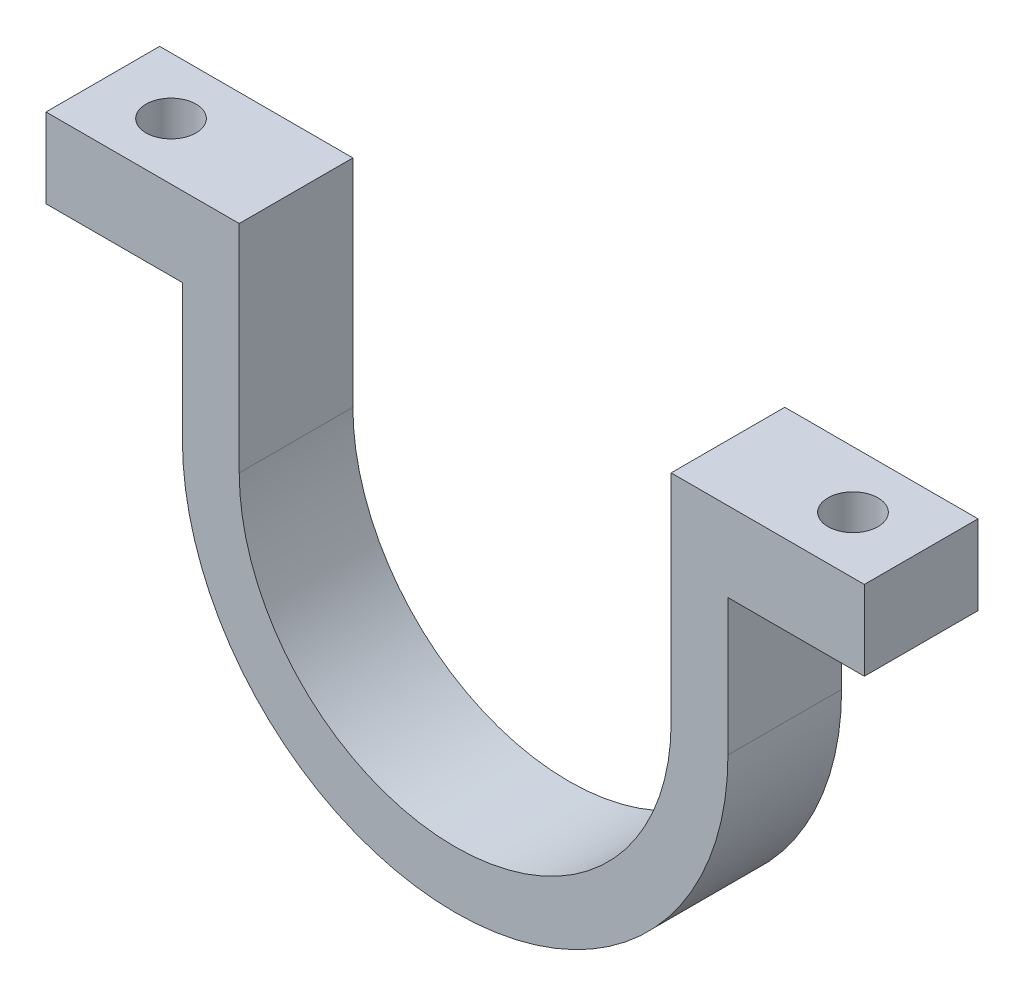
ISO-10303-21;
HEADER;
FILE_DESCRIPTION(('STEP AP214'),'2;1');
FILE_NAME('part.step','',(''),(''),'','','');
FILE_SCHEMA(('AUTOMOTIVE_DESIGN { 1 0 10303 214 1 1 1 1 }'));
ENDSEC;
DATA;
#1=APPLICATION_CONTEXT('core data for automotive mechanical design processes');
#2=APPLICATION_PROTOCOL_DEFINITION('international standard','automotive_design',2000,#1);
#3=PRODUCT_CONTEXT('',#1,'mechanical');
#4=PRODUCT('Part','Part','',(#3));
#5=PRODUCT_RELATED_PRODUCT_CATEGORY('part','',(#4));
#6=PRODUCT_DEFINITION_FORMATION('','',#4);
#7=PRODUCT_DEFINITION_CONTEXT('part definition',#1,'design');
#8=PRODUCT_DEFINITION('design','',#6,#7);
#9=PRODUCT_DEFINITION_SHAPE('','',#8);
#10=(LENGTH_UNIT() NAMED_UNIT(*) SI_UNIT(.MILLI.,.METRE.));
#11=(NAMED_UNIT(*) PLANE_ANGLE_UNIT() SI_UNIT($,.RADIAN.));
#12=(NAMED_UNIT(*) SI_UNIT($,.STERADIAN.) SOLID_ANGLE_UNIT());
#13=UNCERTAINTY_MEASURE_WITH_UNIT(LENGTH_MEASURE(1.E-05),#10,'distance_accuracy_value','');
#14=(GEOMETRIC_REPRESENTATION_CONTEXT(3) GLOBAL_UNCERTAINTY_ASSIGNED_CONTEXT((#13)) GLOBAL_UNIT_ASSIGNED_CONTEXT((#10,
#11,#12)) REPRESENTATION_CONTEXT('',''));
#15=CARTESIAN_POINT('',(0.,0.,0.));
#16=DIRECTION('',(0.,0.,1.));
#17=DIRECTION('',(1.,0.,0.));
#18=AXIS2_PLACEMENT_3D('',#15,#16,#17);
#19=CARTESIAN_POINT('',(-36.,19.,10.));
#20=DIRECTION('',(1.,0.,0.));
#21=DIRECTION('',(0.,0.,-1.));
#22=AXIS2_PLACEMENT_3D('',#19,#20,#21);
#23=PLANE('',#22);
#24=DIRECTION('',(0.,-1.,0.));
#25=VECTOR('',#24,1.);
#26=CARTESIAN_POINT('',(-36.,19.,0.));
#27=LINE('',#26,#25);
#28=CARTESIAN_POINT('',(-36.,19.,0.));
#29=VERTEX_POINT('',#28);
#30=CARTESIAN_POINT('',(-36.,12.,0.));
#31=VERTEX_POINT('',#30);
#32=EDGE_CURVE('E153',#29,#31,#27,.T.);
#33=ORIENTED_EDGE('',*,*,#32,.T.);
#34=DIRECTION('',(0.,0.,-1.));
#35=VECTOR('',#34,1.);
#36=CARTESIAN_POINT('',(-36.,12.,10.));
#37=LINE('',#36,#35);
#38=CARTESIAN_POINT('',(-36.,12.,10.));
#39=VERTEX_POINT('',#38);
#40=EDGE_CURVE('E11',#39,#31,#37,.T.);
#41=ORIENTED_EDGE('',*,*,#40,.F.);
#42=DIRECTION('',(0.,-1.,0.));
#43=VECTOR('',#42,1.);
#44=CARTESIAN_POINT('',(-36.,19.,10.));
#45=LINE('',#44,#43);
#46=CARTESIAN_POINT('',(-36.,19.,10.));
#47=VERTEX_POINT('',#46);
#48=EDGE_CURVE('E176',#47,#39,#45,.T.);
#49=ORIENTED_EDGE('',*,*,#48,.F.);
#50=DIRECTION('',(0.,0.,-1.));
#51=VECTOR('',#50,1.);
#52=CARTESIAN_POINT('',(-36.,19.,10.));
#53=LINE('',#52,#51);
#54=EDGE_CURVE('E149',#47,#29,#53,.T.);
#55=ORIENTED_EDGE('',*,*,#54,.T.);
#56=EDGE_LOOP('',(#33,#41,#49,#55));
#57=FACE_BOUND('',#56,.T.);
#58=ADVANCED_FACE('F33',(#57),#23,.F.);
#59=CARTESIAN_POINT('',(-36.,12.,10.));
#60=DIRECTION('',(0.,1.,0.));
#61=DIRECTION('',(0.,0.,1.));
#62=AXIS2_PLACEMENT_3D('',#59,#60,#61);
#63=PLANE('',#62);
#64=CARTESIAN_POINT('',(-30.,12.,5.));
#65=DIRECTION('',(0.,1.,0.));
#66=DIRECTION('',(0.,0.,1.));
#67=AXIS2_PLACEMENT_3D('',#64,#65,#66);
#68=CIRCLE('',#67,2.2);
#69=CARTESIAN_POINT('',(-30.,12.,7.2));
#70=VERTEX_POINT('',#69);
#71=EDGE_CURVE('E157',#70,#70,#68,.T.);
#72=ORIENTED_EDGE('',*,*,#71,.T.);
#73=EDGE_LOOP('',(#72));
#74=FACE_BOUND('',#73,.T.);
#75=DIRECTION('',(1.,0.,0.));
#76=VECTOR('',#75,1.);
#77=CARTESIAN_POINT('',(-36.,12.,0.));
#78=LINE('',#77,#76);
#79=CARTESIAN_POINT('',(-24.,12.,0.));
#80=VERTEX_POINT('',#79);
#81=EDGE_CURVE('E156',#31,#80,#78,.T.);
#82=ORIENTED_EDGE('',*,*,#81,.T.);
#83=DIRECTION('',(0.,0.,-1.));
#84=VECTOR('',#83,1.);
#85=CARTESIAN_POINT('',(-24.,12.,10.));
#86=LINE('',#85,#84);
#87=CARTESIAN_POINT('',(-24.,12.,10.));
#88=VERTEX_POINT('',#87);
#89=EDGE_CURVE('E41',#88,#80,#86,.T.);
#90=ORIENTED_EDGE('',*,*,#89,.F.);
#91=DIRECTION('',(1.,0.,0.));
#92=VECTOR('',#91,1.);
#93=CARTESIAN_POINT('',(-36.,12.,10.));
#94=LINE('',#93,#92);
#95=EDGE_CURVE('E104',#39,#88,#94,.T.);
#96=ORIENTED_EDGE('',*,*,#95,.F.);
#97=ORIENTED_EDGE('',*,*,#40,.T.);
#98=EDGE_LOOP('',(#82,#90,#96,#97));
#99=FACE_BOUND('',#98,.T.);
#100=ADVANCED_FACE('F256',(#74,#99),#63,.F.);
#101=CARTESIAN_POINT('',(-24.,-1.6759110426447E-13,10.));
#102=DIRECTION('',(1.,0.,0.));
#103=DIRECTION('',(0.,1.,0.));
#104=AXIS2_PLACEMENT_3D('',#101,#102,#103);
#105=PLANE('',#104);
#106=DIRECTION('',(0.,-1.,0.));
#107=VECTOR('',#106,1.);
#108=CARTESIAN_POINT('',(-24.,-1.6759110426447E-13,0.));
#109=LINE('',#108,#107);
#110=CARTESIAN_POINT('',(-24.,-1.56932963228069E-13,0.));
#111=VERTEX_POINT('',#110);
#112=EDGE_CURVE('E159',#80,#111,#109,.T.);
#113=ORIENTED_EDGE('',*,*,#112,.T.);
#114=DIRECTION('',(0.,0.,-1.));
#115=VECTOR('',#114,1.);
#116=CARTESIAN_POINT('',(-24.,-1.56932963228069E-13,10.));
#117=LINE('',#116,#115);
#118=CARTESIAN_POINT('',(-24.,-1.56932963228069E-13,10.));
#119=VERTEX_POINT('',#118);
#120=EDGE_CURVE('E195',#119,#111,#117,.T.);
#121=ORIENTED_EDGE('',*,*,#120,.F.);
#122=DIRECTION('',(0.,-1.,0.));
#123=VECTOR('',#122,1.);
#124=CARTESIAN_POINT('',(-24.,-1.6759110426447E-13,10.));
#125=LINE('',#124,#123);
#126=EDGE_CURVE('E203',#88,#119,#125,.T.);
#127=ORIENTED_EDGE('',*,*,#126,.F.);
#128=ORIENTED_EDGE('',*,*,#89,.T.);
#129=EDGE_LOOP('',(#113,#121,#127,#128));
#130=FACE_BOUND('',#129,.T.);
#131=ADVANCED_FACE('F201',(#130),#105,.F.);
#132=CARTESIAN_POINT('',(0.,0.,10.));
#133=DIRECTION('',(0.,0.,-1.));
#134=DIRECTION('',(-1.,0.,0.));
#135=AXIS2_PLACEMENT_3D('',#132,#133,#134);
#136=CYLINDRICAL_SURFACE('',#135,24.);
#137=CARTESIAN_POINT('',(0.,0.,0.));
#138=DIRECTION('',(0.,0.,1.));
#139=DIRECTION('',(1.,0.,0.));
#140=AXIS2_PLACEMENT_3D('',#137,#138,#139);
#141=CIRCLE('',#140,24.);
#142=CARTESIAN_POINT('',(24.,0.,0.));
#143=VERTEX_POINT('',#142);
#144=EDGE_CURVE('E161',#111,#143,#141,.T.);
#145=ORIENTED_EDGE('',*,*,#144,.T.);
#146=DIRECTION('',(0.,0.,-1.));
#147=VECTOR('',#146,1.);
#148=CARTESIAN_POINT('',(24.,0.,10.));
#149=LINE('',#148,#147);
#150=CARTESIAN_POINT('',(24.,0.,10.));
#151=VERTEX_POINT('',#150);
#152=EDGE_CURVE('E192',#151,#143,#149,.T.);
#153=ORIENTED_EDGE('',*,*,#152,.F.);
#154=CARTESIAN_POINT('',(0.,0.,10.));
#155=DIRECTION('',(0.,0.,1.));
#156=DIRECTION('',(1.,0.,0.));
#157=AXIS2_PLACEMENT_3D('',#154,#155,#156);
#158=CIRCLE('',#157,24.);
#159=EDGE_CURVE('E221',#119,#151,#158,.T.);
#160=ORIENTED_EDGE('',*,*,#159,.F.);
#161=ORIENTED_EDGE('',*,*,#120,.T.);
#162=EDGE_LOOP('',(#145,#153,#160,#161));
#163=FACE_BOUND('',#162,.T.);
#164=ADVANCED_FACE('F212',(#163),#136,.T.);
#165=CARTESIAN_POINT('',(24.,0.,10.));
#166=DIRECTION('',(-1.,0.,0.));
#167=DIRECTION('',(0.,-1.,0.));
#168=AXIS2_PLACEMENT_3D('',#165,#166,#167);
#169=PLANE('',#168);
#170=DIRECTION('',(0.,1.,0.));
#171=VECTOR('',#170,1.);
#172=CARTESIAN_POINT('',(24.,0.,0.));
#173=LINE('',#172,#171);
#174=CARTESIAN_POINT('',(24.,12.,0.));
#175=VERTEX_POINT('',#174);
#176=EDGE_CURVE('E163',#143,#175,#173,.T.);
#177=ORIENTED_EDGE('',*,*,#176,.T.);
#178=DIRECTION('',(0.,0.,-1.));
#179=VECTOR('',#178,1.);
#180=CARTESIAN_POINT('',(24.,12.,10.));
#181=LINE('',#180,#179);
#182=CARTESIAN_POINT('',(24.,12.,10.));
#183=VERTEX_POINT('',#182);
#184=EDGE_CURVE('E189',#183,#175,#181,.T.);
#185=ORIENTED_EDGE('',*,*,#184,.F.);
#186=DIRECTION('',(0.,1.,0.));
#187=VECTOR('',#186,1.);
#188=CARTESIAN_POINT('',(24.,0.,10.));
#189=LINE('',#188,#187);
#190=EDGE_CURVE('E218',#151,#183,#189,.T.);
#191=ORIENTED_EDGE('',*,*,#190,.F.);
#192=ORIENTED_EDGE('',*,*,#152,.T.);
#193=EDGE_LOOP('',(#177,#185,#191,#192));
#194=FACE_BOUND('',#193,.T.);
#195=ADVANCED_FACE('F216',(#194),#169,.F.);
#196=CARTESIAN_POINT('',(24.,12.,10.));
#197=DIRECTION('',(0.,1.,0.));
#198=DIRECTION('',(0.,0.,1.));
#199=AXIS2_PLACEMENT_3D('',#196,#197,#198);
#200=PLANE('',#199);
#201=CARTESIAN_POINT('',(30.,12.,5.00000000000004));
#202=DIRECTION('',(0.,1.,0.));
#203=DIRECTION('',(0.,0.,1.));
#204=AXIS2_PLACEMENT_3D('',#201,#202,#203);
#205=CIRCLE('',#204,2.2);
#206=CARTESIAN_POINT('',(30.,12.,7.20000000000004));
#207=VERTEX_POINT('',#206);
#208=EDGE_CURVE('E361',#207,#207,#205,.T.);
#209=ORIENTED_EDGE('',*,*,#208,.T.);
#210=EDGE_LOOP('',(#209));
#211=FACE_BOUND('',#210,.T.);
#212=DIRECTION('',(1.,0.,0.));
#213=VECTOR('',#212,1.);
#214=CARTESIAN_POINT('',(24.,12.,0.));
#215=LINE('',#214,#213);
#216=CARTESIAN_POINT('',(36.,12.,0.));
#217=VERTEX_POINT('',#216);
#218=EDGE_CURVE('E165',#175,#217,#215,.T.);
#219=ORIENTED_EDGE('',*,*,#218,.T.);
#220=DIRECTION('',(0.,0.,-1.));
#221=VECTOR('',#220,1.);
#222=CARTESIAN_POINT('',(36.,12.,10.));
#223=LINE('',#222,#221);
#224=CARTESIAN_POINT('',(36.,12.,10.));
#225=VERTEX_POINT('',#224);
#226=EDGE_CURVE('E186',#225,#217,#223,.T.);
#227=ORIENTED_EDGE('',*,*,#226,.F.);
#228=DIRECTION('',(1.,0.,0.));
#229=VECTOR('',#228,1.);
#230=CARTESIAN_POINT('',(24.,12.,10.));
#231=LINE('',#230,#229);
#232=EDGE_CURVE('E220',#183,#225,#231,.T.);
#233=ORIENTED_EDGE('',*,*,#232,.F.);
#234=ORIENTED_EDGE('',*,*,#184,.T.);
#235=EDGE_LOOP('',(#219,#227,#233,#234));
#236=FACE_BOUND('',#235,.T.);
#237=ADVANCED_FACE('F271',(#211,#236),#200,.F.);
#238=CARTESIAN_POINT('',(36.,19.,10.));
#239=DIRECTION('',(-1.,0.,0.));
#240=DIRECTION('',(0.,0.,1.));
#241=AXIS2_PLACEMENT_3D('',#238,#239,#240);
#242=PLANE('',#241);
#243=DIRECTION('',(0.,1.,0.));
#244=VECTOR('',#243,1.);
#245=CARTESIAN_POINT('',(36.,19.,0.));
#246=LINE('',#245,#244);
#247=CARTESIAN_POINT('',(36.,19.,0.));
#248=VERTEX_POINT('',#247);
#249=EDGE_CURVE('E167',#217,#248,#246,.T.);
#250=ORIENTED_EDGE('',*,*,#249,.T.);
#251=DIRECTION('',(0.,0.,-1.));
#252=VECTOR('',#251,1.);
#253=CARTESIAN_POINT('',(36.,19.,10.));
#254=LINE('',#253,#252);
#255=CARTESIAN_POINT('',(36.,19.,10.));
#256=VERTEX_POINT('',#255);
#257=EDGE_CURVE('E183',#256,#248,#254,.T.);
#258=ORIENTED_EDGE('',*,*,#257,.F.);
#259=DIRECTION('',(0.,1.,0.));
#260=VECTOR('',#259,1.);
#261=CARTESIAN_POINT('',(36.,19.,10.));
#262=LINE('',#261,#260);
#263=EDGE_CURVE('E223',#225,#256,#262,.T.);
#264=ORIENTED_EDGE('',*,*,#263,.F.);
#265=ORIENTED_EDGE('',*,*,#226,.T.);
#266=EDGE_LOOP('',(#250,#258,#264,#265));
#267=FACE_BOUND('',#266,.T.);
#268=ADVANCED_FACE('F274',(#267),#242,.F.);
#269=CARTESIAN_POINT('',(19.,19.,10.));
#270=DIRECTION('',(0.,-1.,0.));
#271=DIRECTION('',(0.,0.,-1.));
#272=AXIS2_PLACEMENT_3D('',#269,#270,#271);
#273=PLANE('',#272);
#274=CARTESIAN_POINT('',(30.,19.,5.00000000000004));
#275=DIRECTION('',(0.,1.,0.));
#276=DIRECTION('',(0.,0.,-1.));
#277=AXIS2_PLACEMENT_3D('',#274,#275,#276);
#278=CIRCLE('',#277,2.2);
#279=CARTESIAN_POINT('',(30.,19.,2.80000000000004));
#280=VERTEX_POINT('',#279);
#281=EDGE_CURVE('E358',#280,#280,#278,.T.);
#282=ORIENTED_EDGE('',*,*,#281,.F.);
#283=EDGE_LOOP('',(#282));
#284=FACE_BOUND('',#283,.T.);
#285=DIRECTION('',(-1.,0.,0.));
#286=VECTOR('',#285,1.);
#287=CARTESIAN_POINT('',(19.,19.,0.));
#288=LINE('',#287,#286);
#289=CARTESIAN_POINT('',(19.,19.,0.));
#290=VERTEX_POINT('',#289);
#291=EDGE_CURVE('E169',#248,#290,#288,.T.);
#292=ORIENTED_EDGE('',*,*,#291,.T.);
#293=DIRECTION('',(0.,0.,-1.));
#294=VECTOR('',#293,1.);
#295=CARTESIAN_POINT('',(19.,19.,10.));
#296=LINE('',#295,#294);
#297=CARTESIAN_POINT('',(19.,19.,10.));
#298=VERTEX_POINT('',#297);
#299=EDGE_CURVE('E180',#298,#290,#296,.T.);
#300=ORIENTED_EDGE('',*,*,#299,.F.);
#301=DIRECTION('',(-1.,0.,0.));
#302=VECTOR('',#301,1.);
#303=CARTESIAN_POINT('',(19.,19.,10.));
#304=LINE('',#303,#302);
#305=EDGE_CURVE('E229',#256,#298,#304,.T.);
#306=ORIENTED_EDGE('',*,*,#305,.F.);
#307=ORIENTED_EDGE('',*,*,#257,.T.);
#308=EDGE_LOOP('',(#292,#300,#306,#307));
#309=FACE_BOUND('',#308,.T.);
#310=ADVANCED_FACE('F235',(#284,#309),#273,.F.);
#311=CARTESIAN_POINT('',(19.,0.,10.));
#312=DIRECTION('',(1.,0.,0.));
#313=DIRECTION('',(0.,0.,-1.));
#314=AXIS2_PLACEMENT_3D('',#311,#312,#313);
#315=PLANE('',#314);
#316=DIRECTION('',(0.,-1.,0.));
#317=VECTOR('',#316,1.);
#318=CARTESIAN_POINT('',(19.,0.,0.));
#319=LINE('',#318,#317);
#320=CARTESIAN_POINT('',(19.,0.,0.));
#321=VERTEX_POINT('',#320);
#322=EDGE_CURVE('E171',#290,#321,#319,.T.);
#323=ORIENTED_EDGE('',*,*,#322,.T.);
#324=DIRECTION('',(0.,0.,-1.));
#325=VECTOR('',#324,1.);
#326=CARTESIAN_POINT('',(19.,0.,10.));
#327=LINE('',#326,#325);
#328=CARTESIAN_POINT('',(19.,0.,10.));
#329=VERTEX_POINT('',#328);
#330=EDGE_CURVE('E144',#329,#321,#327,.T.);
#331=ORIENTED_EDGE('',*,*,#330,.F.);
#332=DIRECTION('',(0.,-1.,0.));
#333=VECTOR('',#332,1.);
#334=CARTESIAN_POINT('',(19.,0.,10.));
#335=LINE('',#334,#333);
#336=EDGE_CURVE('E135',#298,#329,#335,.T.);
#337=ORIENTED_EDGE('',*,*,#336,.F.);
#338=ORIENTED_EDGE('',*,*,#299,.T.);
#339=EDGE_LOOP('',(#323,#331,#337,#338));
#340=FACE_BOUND('',#339,.T.);
#341=ADVANCED_FACE('F239',(#340),#315,.F.);
#342=CARTESIAN_POINT('',(0.,0.,10.));
#343=DIRECTION('',(0.,0.,-1.));
#344=DIRECTION('',(-1.,0.,0.));
#345=AXIS2_PLACEMENT_3D('',#342,#343,#344);
#346=CYLINDRICAL_SURFACE('',#345,19.);
#347=CARTESIAN_POINT('',(0.,0.,0.));
#348=DIRECTION('',(0.,0.,-1.));
#349=DIRECTION('',(1.,0.,0.));
#350=AXIS2_PLACEMENT_3D('',#347,#348,#349);
#351=CIRCLE('',#350,19.);
#352=CARTESIAN_POINT('',(-19.,-1.32676290876039E-13,0.));
#353=VERTEX_POINT('',#352);
#354=EDGE_CURVE('E143',#321,#353,#351,.T.);
#355=ORIENTED_EDGE('',*,*,#354,.T.);
#356=DIRECTION('',(0.,0.,-1.));
#357=VECTOR('',#356,1.);
#358=CARTESIAN_POINT('',(-19.,-1.32676290876039E-13,10.));
#359=LINE('',#358,#357);
#360=CARTESIAN_POINT('',(-19.,-1.32676290876039E-13,10.));
#361=VERTEX_POINT('',#360);
#362=EDGE_CURVE('E140',#361,#353,#359,.T.);
#363=ORIENTED_EDGE('',*,*,#362,.F.);
#364=CARTESIAN_POINT('',(0.,0.,10.));
#365=DIRECTION('',(0.,0.,-1.));
#366=DIRECTION('',(1.,0.,0.));
#367=AXIS2_PLACEMENT_3D('',#364,#365,#366);
#368=CIRCLE('',#367,19.);
#369=EDGE_CURVE('E129',#329,#361,#368,.T.);
#370=ORIENTED_EDGE('',*,*,#369,.F.);
#371=ORIENTED_EDGE('',*,*,#330,.T.);
#372=EDGE_LOOP('',(#355,#363,#370,#371));
#373=FACE_BOUND('',#372,.T.);
#374=ADVANCED_FACE('F141',(#373),#346,.F.);
#375=CARTESIAN_POINT('',(-19.,-1.32676290876039E-13,10.));
#376=DIRECTION('',(-1.,0.,0.));
#377=DIRECTION('',(0.,0.,1.));
#378=AXIS2_PLACEMENT_3D('',#375,#376,#377);
#379=PLANE('',#378);
#380=DIRECTION('',(0.,1.,0.));
#381=VECTOR('',#380,1.);
#382=CARTESIAN_POINT('',(-19.,-1.32676290876039E-13,0.));
#383=LINE('',#382,#381);
#384=CARTESIAN_POINT('',(-19.,19.,0.));
#385=VERTEX_POINT('',#384);
#386=EDGE_CURVE('E90',#353,#385,#383,.T.);
#387=ORIENTED_EDGE('',*,*,#386,.T.);
#388=DIRECTION('',(0.,0.,-1.));
#389=VECTOR('',#388,1.);
#390=CARTESIAN_POINT('',(-19.,19.,10.));
#391=LINE('',#390,#389);
#392=CARTESIAN_POINT('',(-19.,19.,10.));
#393=VERTEX_POINT('',#392);
#394=EDGE_CURVE('E145',#393,#385,#391,.T.);
#395=ORIENTED_EDGE('',*,*,#394,.F.);
#396=DIRECTION('',(0.,1.,0.));
#397=VECTOR('',#396,1.);
#398=CARTESIAN_POINT('',(-19.,-1.32676290876039E-13,10.));
#399=LINE('',#398,#397);
#400=EDGE_CURVE('E133',#361,#393,#399,.T.);
#401=ORIENTED_EDGE('',*,*,#400,.F.);
#402=ORIENTED_EDGE('',*,*,#362,.T.);
#403=EDGE_LOOP('',(#387,#395,#401,#402));
#404=FACE_BOUND('',#403,.T.);
#405=ADVANCED_FACE('F147',(#404),#379,.F.);
#406=CARTESIAN_POINT('',(-36.,19.,10.));
#407=DIRECTION('',(0.,-1.,0.));
#408=DIRECTION('',(0.,0.,-1.));
#409=AXIS2_PLACEMENT_3D('',#406,#407,#408);
#410=PLANE('',#409);
#411=CARTESIAN_POINT('',(-30.,19.,5.));
#412=DIRECTION('',(0.,1.,0.));
#413=DIRECTION('',(0.,0.,1.));
#414=AXIS2_PLACEMENT_3D('',#411,#412,#413);
#415=CIRCLE('',#414,2.2);
#416=CARTESIAN_POINT('',(-30.,19.,7.2));
#417=VERTEX_POINT('',#416);
#418=EDGE_CURVE('E362',#417,#417,#415,.T.);
#419=ORIENTED_EDGE('',*,*,#418,.F.);
#420=EDGE_LOOP('',(#419));
#421=FACE_BOUND('',#420,.T.);
#422=DIRECTION('',(-1.,0.,0.));
#423=VECTOR('',#422,1.);
#424=CARTESIAN_POINT('',(-36.,19.,0.));
#425=LINE('',#424,#423);
#426=EDGE_CURVE('E96',#385,#29,#425,.T.);
#427=ORIENTED_EDGE('',*,*,#426,.T.);
#428=ORIENTED_EDGE('',*,*,#54,.F.);
#429=DIRECTION('',(-1.,0.,0.));
#430=VECTOR('',#429,1.);
#431=CARTESIAN_POINT('',(-36.,19.,10.));
#432=LINE('',#431,#430);
#433=EDGE_CURVE('E49',#393,#47,#432,.T.);
#434=ORIENTED_EDGE('',*,*,#433,.F.);
#435=ORIENTED_EDGE('',*,*,#394,.T.);
#436=EDGE_LOOP('',(#427,#428,#434,#435));
#437=FACE_BOUND('',#436,.T.);
#438=ADVANCED_FACE('F243',(#421,#437),#410,.F.);
#439=CARTESIAN_POINT('',(0.,0.,10.));
#440=DIRECTION('',(0.,0.,1.));
#441=DIRECTION('',(1.,0.,0.));
#442=AXIS2_PLACEMENT_3D('',#439,#440,#441);
#443=PLANE('',#442);
#444=ORIENTED_EDGE('',*,*,#48,.T.);
#445=ORIENTED_EDGE('',*,*,#95,.T.);
#446=ORIENTED_EDGE('',*,*,#126,.T.);
#447=ORIENTED_EDGE('',*,*,#159,.T.);
#448=ORIENTED_EDGE('',*,*,#190,.T.);
#449=ORIENTED_EDGE('',*,*,#232,.T.);
#450=ORIENTED_EDGE('',*,*,#263,.T.);
#451=ORIENTED_EDGE('',*,*,#305,.T.);
#452=ORIENTED_EDGE('',*,*,#336,.T.);
#453=ORIENTED_EDGE('',*,*,#369,.T.);
#454=ORIENTED_EDGE('',*,*,#400,.T.);
#455=ORIENTED_EDGE('',*,*,#433,.T.);
#456=EDGE_LOOP('',(#444,#445,#446,#447,#448,#449,#450,#451,#452,#453,#454,#455));
#457=FACE_BOUND('',#456,.T.);
#458=ADVANCED_FACE('F131',(#457),#443,.T.);
#459=CARTESIAN_POINT('',(0.,0.,0.));
#460=DIRECTION('',(0.,0.,1.));
#461=DIRECTION('',(1.,0.,0.));
#462=AXIS2_PLACEMENT_3D('',#459,#460,#461);
#463=PLANE('',#462);
#464=ORIENTED_EDGE('',*,*,#32,.F.);
#465=ORIENTED_EDGE('',*,*,#426,.F.);
#466=ORIENTED_EDGE('',*,*,#386,.F.);
#467=ORIENTED_EDGE('',*,*,#354,.F.);
#468=ORIENTED_EDGE('',*,*,#322,.F.);
#469=ORIENTED_EDGE('',*,*,#291,.F.);
#470=ORIENTED_EDGE('',*,*,#249,.F.);
#471=ORIENTED_EDGE('',*,*,#218,.F.);
#472=ORIENTED_EDGE('',*,*,#176,.F.);
#473=ORIENTED_EDGE('',*,*,#144,.F.);
#474=ORIENTED_EDGE('',*,*,#112,.F.);
#475=ORIENTED_EDGE('',*,*,#81,.F.);
#476=EDGE_LOOP('',(#464,#465,#466,#467,#468,#469,#470,#471,#472,#473,#474,#475));
#477=FACE_BOUND('',#476,.T.);
#478=ADVANCED_FACE('F207',(#477),#463,.F.);
#479=CARTESIAN_POINT('',(-30.,9.,5.));
#480=DIRECTION('',(0.,1.,0.));
#481=DIRECTION('',(0.,0.,1.));
#482=AXIS2_PLACEMENT_3D('',#479,#480,#481);
#483=CYLINDRICAL_SURFACE('',#482,2.2);
#484=ORIENTED_EDGE('',*,*,#418,.T.);
#485=EDGE_LOOP('',(#484));
#486=FACE_BOUND('',#485,.T.);
#487=ORIENTED_EDGE('',*,*,#71,.F.);
#488=EDGE_LOOP('',(#487));
#489=FACE_BOUND('',#488,.T.);
#490=ADVANCED_FACE('F308',(#486,#489),#483,.F.);
#491=CARTESIAN_POINT('',(30.,9.,5.00000000000004));
#492=DIRECTION('',(0.,1.,0.));
#493=DIRECTION('',(0.,0.,1.));
#494=AXIS2_PLACEMENT_3D('',#491,#492,#493);
#495=CYLINDRICAL_SURFACE('',#494,2.2);
#496=ORIENTED_EDGE('',*,*,#281,.T.);
#497=EDGE_LOOP('',(#496));
#498=FACE_BOUND('',#497,.T.);
#499=ORIENTED_EDGE('',*,*,#208,.F.);
#500=EDGE_LOOP('',(#499));
#501=FACE_BOUND('',#500,.T.);
#502=ADVANCED_FACE('F341',(#498,#501),#495,.F.);
#503=CLOSED_SHELL('',(#58,#100,#131,#164,#195,#237,#268,#310,#341,#374,#405,#438,#458,#478,#490,#502));
#504=MANIFOLD_SOLID_BREP('B2',#503);
#505=ADVANCED_BREP_SHAPE_REPRESENTATION('',(#18,#504),#14);
#506=SHAPE_DEFINITION_REPRESENTATION(#9,#505);
ENDSEC;
END-ISO-10303-21;
